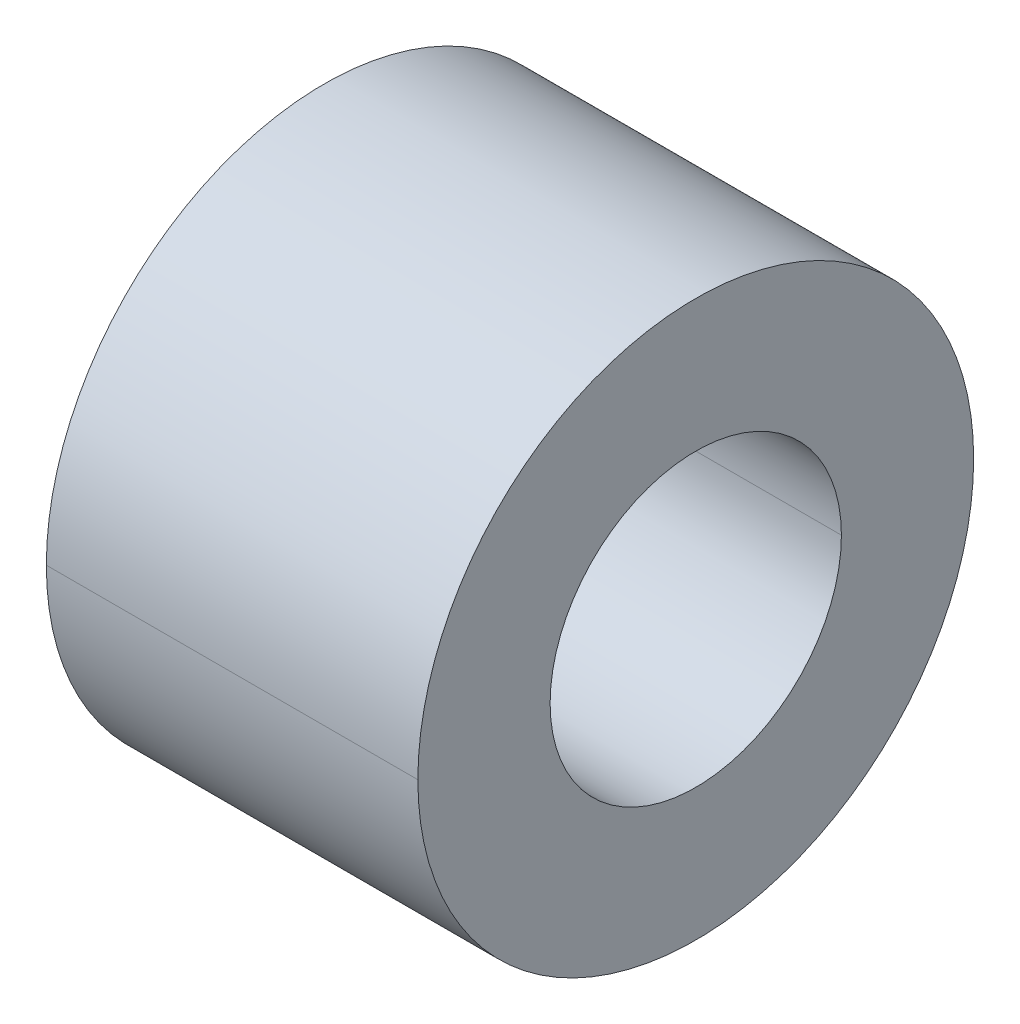
ISO-10303-21;
HEADER;
FILE_DESCRIPTION(('STEP AP214'),'2;1');
FILE_NAME('part.step','',(''),(''),'','','');
FILE_SCHEMA(('AUTOMOTIVE_DESIGN { 1 0 10303 214 1 1 1 1 }'));
ENDSEC;
DATA;
#1=APPLICATION_CONTEXT('core data for automotive mechanical design processes');
#2=APPLICATION_PROTOCOL_DEFINITION('international standard','automotive_design',2000,#1);
#3=PRODUCT_CONTEXT('',#1,'mechanical');
#4=PRODUCT('Part','Part','',(#3));
#5=PRODUCT_RELATED_PRODUCT_CATEGORY('part','',(#4));
#6=PRODUCT_DEFINITION_FORMATION('','',#4);
#7=PRODUCT_DEFINITION_CONTEXT('part definition',#1,'design');
#8=PRODUCT_DEFINITION('design','',#6,#7);
#9=PRODUCT_DEFINITION_SHAPE('','',#8);
#10=(LENGTH_UNIT() NAMED_UNIT(*) SI_UNIT(.MILLI.,.METRE.));
#11=(NAMED_UNIT(*) PLANE_ANGLE_UNIT() SI_UNIT($,.RADIAN.));
#12=(NAMED_UNIT(*) SI_UNIT($,.STERADIAN.) SOLID_ANGLE_UNIT());
#13=UNCERTAINTY_MEASURE_WITH_UNIT(LENGTH_MEASURE(1.E-05),#10,'distance_accuracy_value','');
#14=(GEOMETRIC_REPRESENTATION_CONTEXT(3) GLOBAL_UNCERTAINTY_ASSIGNED_CONTEXT((#13)) GLOBAL_UNIT_ASSIGNED_CONTEXT((#10,
#11,#12)) REPRESENTATION_CONTEXT('',''));
#15=CARTESIAN_POINT('',(0.,0.,0.));
#16=DIRECTION('',(0.,0.,1.));
#17=DIRECTION('',(1.,0.,0.));
#18=AXIS2_PLACEMENT_3D('',#15,#16,#17);
#19=CARTESIAN_POINT('',(3.175,0.,0.));
#20=DIRECTION('',(-1.,0.,0.));
#21=DIRECTION('',(0.,0.,1.));
#22=AXIS2_PLACEMENT_3D('',#19,#20,#21);
#23=CYLINDRICAL_SURFACE('',#22,2.4892);
#24=DIRECTION('',(-1.,0.,0.));
#25=VECTOR('',#24,1.);
#26=CARTESIAN_POINT('',(3.175,0.,-2.4892));
#27=LINE('',#26,#25);
#28=CARTESIAN_POINT('',(3.175,0.,-2.4892));
#29=VERTEX_POINT('',#28);
#30=CARTESIAN_POINT('',(-3.175,0.,-2.4892));
#31=VERTEX_POINT('',#30);
#32=EDGE_CURVE('E100',#29,#31,#27,.T.);
#33=ORIENTED_EDGE('',*,*,#32,.F.);
#34=CARTESIAN_POINT('',(3.175,0.,0.));
#35=DIRECTION('',(1.,0.,0.));
#36=DIRECTION('',(0.,0.,-1.));
#37=AXIS2_PLACEMENT_3D('',#34,#35,#36);
#38=CIRCLE('',#37,2.4892);
#39=CARTESIAN_POINT('',(3.175,0.,2.4892));
#40=VERTEX_POINT('',#39);
#41=EDGE_CURVE('E73',#29,#40,#38,.T.);
#42=ORIENTED_EDGE('',*,*,#41,.T.);
#43=DIRECTION('',(-1.,0.,0.));
#44=VECTOR('',#43,1.);
#45=CARTESIAN_POINT('',(3.175,0.,2.4892));
#46=LINE('',#45,#44);
#47=CARTESIAN_POINT('',(-3.175,0.,2.4892));
#48=VERTEX_POINT('',#47);
#49=EDGE_CURVE('E86',#40,#48,#46,.T.);
#50=ORIENTED_EDGE('',*,*,#49,.T.);
#51=CARTESIAN_POINT('',(-3.175,0.,0.));
#52=DIRECTION('',(1.,0.,0.));
#53=DIRECTION('',(0.,0.,-1.));
#54=AXIS2_PLACEMENT_3D('',#51,#52,#53);
#55=CIRCLE('',#54,2.4892);
#56=EDGE_CURVE('E11',#31,#48,#55,.T.);
#57=ORIENTED_EDGE('',*,*,#56,.F.);
#58=EDGE_LOOP('',(#33,#42,#50,#57));
#59=FACE_BOUND('',#58,.T.);
#60=ADVANCED_FACE('F16',(#59),#23,.F.);
#61=CARTESIAN_POINT('',(3.175,0.,0.));
#62=DIRECTION('',(-1.,0.,0.));
#63=DIRECTION('',(0.,0.,1.));
#64=AXIS2_PLACEMENT_3D('',#61,#62,#63);
#65=CYLINDRICAL_SURFACE('',#64,4.7498);
#66=DIRECTION('',(-1.,0.,0.));
#67=VECTOR('',#66,1.);
#68=CARTESIAN_POINT('',(3.175,0.,-4.7498));
#69=LINE('',#68,#67);
#70=CARTESIAN_POINT('',(3.175,0.,-4.7498));
#71=VERTEX_POINT('',#70);
#72=CARTESIAN_POINT('',(-3.175,0.,-4.7498));
#73=VERTEX_POINT('',#72);
#74=EDGE_CURVE('E77',#71,#73,#69,.T.);
#75=ORIENTED_EDGE('',*,*,#74,.F.);
#76=CARTESIAN_POINT('',(3.175,0.,0.));
#77=DIRECTION('',(1.,0.,0.));
#78=DIRECTION('',(0.,0.,-1.));
#79=AXIS2_PLACEMENT_3D('',#76,#77,#78);
#80=CIRCLE('',#79,4.7498);
#81=CARTESIAN_POINT('',(3.175,0.,4.7498));
#82=VERTEX_POINT('',#81);
#83=EDGE_CURVE('E62',#82,#71,#80,.T.);
#84=ORIENTED_EDGE('',*,*,#83,.F.);
#85=DIRECTION('',(-1.,0.,0.));
#86=VECTOR('',#85,1.);
#87=CARTESIAN_POINT('',(3.175,0.,4.7498));
#88=LINE('',#87,#86);
#89=CARTESIAN_POINT('',(-3.175,0.,4.7498));
#90=VERTEX_POINT('',#89);
#91=EDGE_CURVE('E74',#82,#90,#88,.T.);
#92=ORIENTED_EDGE('',*,*,#91,.T.);
#93=CARTESIAN_POINT('',(-3.175,0.,0.));
#94=DIRECTION('',(1.,0.,0.));
#95=DIRECTION('',(0.,0.,-1.));
#96=AXIS2_PLACEMENT_3D('',#93,#94,#95);
#97=CIRCLE('',#96,4.7498);
#98=EDGE_CURVE('E19',#90,#73,#97,.T.);
#99=ORIENTED_EDGE('',*,*,#98,.T.);
#100=EDGE_LOOP('',(#75,#84,#92,#99));
#101=FACE_BOUND('',#100,.T.);
#102=ADVANCED_FACE('F78',(#101),#65,.T.);
#103=CARTESIAN_POINT('',(-3.175,0.,0.));
#104=DIRECTION('',(1.,0.,0.));
#105=DIRECTION('',(0.,1.,0.));
#106=AXIS2_PLACEMENT_3D('',#103,#104,#105);
#107=PLANE('',#106);
#108=CARTESIAN_POINT('',(-3.175,0.,0.));
#109=DIRECTION('',(1.,0.,0.));
#110=DIRECTION('',(0.,0.,-1.));
#111=AXIS2_PLACEMENT_3D('',#108,#109,#110);
#112=CIRCLE('',#111,2.4892);
#113=EDGE_CURVE('E93',#48,#31,#112,.T.);
#114=ORIENTED_EDGE('',*,*,#113,.T.);
#115=ORIENTED_EDGE('',*,*,#56,.T.);
#116=EDGE_LOOP('',(#114,#115));
#117=FACE_BOUND('',#116,.T.);
#118=ORIENTED_EDGE('',*,*,#98,.F.);
#119=CARTESIAN_POINT('',(-3.175,0.,0.));
#120=DIRECTION('',(1.,0.,0.));
#121=DIRECTION('',(0.,0.,-1.));
#122=AXIS2_PLACEMENT_3D('',#119,#120,#121);
#123=CIRCLE('',#122,4.7498);
#124=EDGE_CURVE('E82',#73,#90,#123,.T.);
#125=ORIENTED_EDGE('',*,*,#124,.F.);
#126=EDGE_LOOP('',(#118,#125));
#127=FACE_BOUND('',#126,.T.);
#128=ADVANCED_FACE('F159',(#117,#127),#107,.F.);
#129=CARTESIAN_POINT('',(3.175,0.,0.));
#130=DIRECTION('',(1.,0.,0.));
#131=DIRECTION('',(0.,1.,0.));
#132=AXIS2_PLACEMENT_3D('',#129,#130,#131);
#133=PLANE('',#132);
#134=CARTESIAN_POINT('',(3.175,0.,0.));
#135=DIRECTION('',(1.,0.,0.));
#136=DIRECTION('',(0.,0.,-1.));
#137=AXIS2_PLACEMENT_3D('',#134,#135,#136);
#138=CIRCLE('',#137,2.4892);
#139=EDGE_CURVE('E104',#40,#29,#138,.T.);
#140=ORIENTED_EDGE('',*,*,#139,.F.);
#141=ORIENTED_EDGE('',*,*,#41,.F.);
#142=EDGE_LOOP('',(#140,#141));
#143=FACE_BOUND('',#142,.T.);
#144=ORIENTED_EDGE('',*,*,#83,.T.);
#145=CARTESIAN_POINT('',(3.175,0.,0.));
#146=DIRECTION('',(1.,0.,0.));
#147=DIRECTION('',(0.,0.,-1.));
#148=AXIS2_PLACEMENT_3D('',#145,#146,#147);
#149=CIRCLE('',#148,4.7498);
#150=EDGE_CURVE('E71',#71,#82,#149,.T.);
#151=ORIENTED_EDGE('',*,*,#150,.T.);
#152=EDGE_LOOP('',(#144,#151));
#153=FACE_BOUND('',#152,.T.);
#154=ADVANCED_FACE('F69',(#143,#153),#133,.T.);
#155=CARTESIAN_POINT('',(3.175,0.,0.));
#156=DIRECTION('',(-1.,0.,0.));
#157=DIRECTION('',(0.,0.,1.));
#158=AXIS2_PLACEMENT_3D('',#155,#156,#157);
#159=CYLINDRICAL_SURFACE('',#158,4.7498);
#160=ORIENTED_EDGE('',*,*,#150,.F.);
#161=ORIENTED_EDGE('',*,*,#74,.T.);
#162=ORIENTED_EDGE('',*,*,#124,.T.);
#163=ORIENTED_EDGE('',*,*,#91,.F.);
#164=EDGE_LOOP('',(#160,#161,#162,#163));
#165=FACE_BOUND('',#164,.T.);
#166=ADVANCED_FACE('F84',(#165),#159,.T.);
#167=CARTESIAN_POINT('',(3.175,0.,0.));
#168=DIRECTION('',(-1.,0.,0.));
#169=DIRECTION('',(0.,0.,1.));
#170=AXIS2_PLACEMENT_3D('',#167,#168,#169);
#171=CYLINDRICAL_SURFACE('',#170,2.4892);
#172=ORIENTED_EDGE('',*,*,#139,.T.);
#173=ORIENTED_EDGE('',*,*,#32,.T.);
#174=ORIENTED_EDGE('',*,*,#113,.F.);
#175=ORIENTED_EDGE('',*,*,#49,.F.);
#176=EDGE_LOOP('',(#172,#173,#174,#175));
#177=FACE_BOUND('',#176,.T.);
#178=ADVANCED_FACE('F130',(#177),#171,.F.);
#179=CLOSED_SHELL('',(#60,#102,#128,#154,#166,#178));
#180=MANIFOLD_SOLID_BREP('B1',#179);
#181=ADVANCED_BREP_SHAPE_REPRESENTATION('',(#18,#180),#14);
#182=SHAPE_DEFINITION_REPRESENTATION(#9,#181);
ENDSEC;
END-ISO-10303-21;
